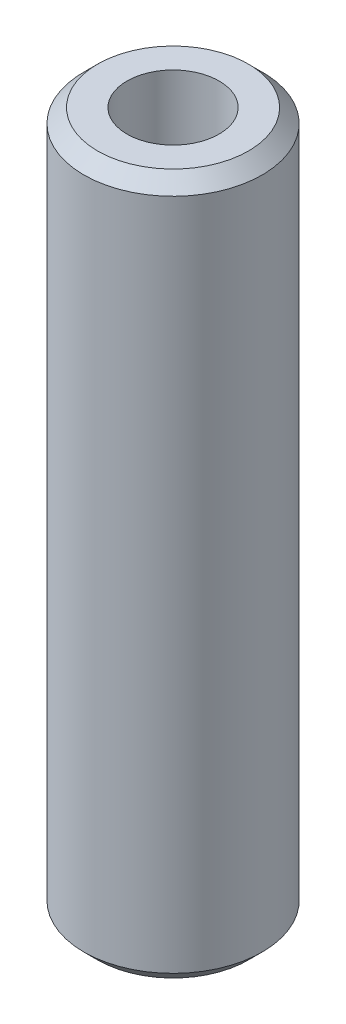
ISO-10303-21;
HEADER;
FILE_DESCRIPTION(('STEP AP214'),'2;1');
FILE_NAME('part.step','',(''),(''),'','','');
FILE_SCHEMA(('AUTOMOTIVE_DESIGN { 1 0 10303 214 1 1 1 1 }'));
ENDSEC;
DATA;
#1=APPLICATION_CONTEXT('core data for automotive mechanical design processes');
#2=APPLICATION_PROTOCOL_DEFINITION('international standard','automotive_design',2000,#1);
#3=PRODUCT_CONTEXT('',#1,'mechanical');
#4=PRODUCT('Part','Part','',(#3));
#5=PRODUCT_RELATED_PRODUCT_CATEGORY('part','',(#4));
#6=PRODUCT_DEFINITION_FORMATION('','',#4);
#7=PRODUCT_DEFINITION_CONTEXT('part definition',#1,'design');
#8=PRODUCT_DEFINITION('design','',#6,#7);
#9=PRODUCT_DEFINITION_SHAPE('','',#8);
#10=(LENGTH_UNIT() NAMED_UNIT(*) SI_UNIT(.MILLI.,.METRE.));
#11=(NAMED_UNIT(*) PLANE_ANGLE_UNIT() SI_UNIT($,.RADIAN.));
#12=(NAMED_UNIT(*) SI_UNIT($,.STERADIAN.) SOLID_ANGLE_UNIT());
#13=UNCERTAINTY_MEASURE_WITH_UNIT(LENGTH_MEASURE(1.E-05),#10,'distance_accuracy_value','');
#14=(GEOMETRIC_REPRESENTATION_CONTEXT(3) GLOBAL_UNCERTAINTY_ASSIGNED_CONTEXT((#13)) GLOBAL_UNIT_ASSIGNED_CONTEXT((#10,
#11,#12)) REPRESENTATION_CONTEXT('',''));
#15=CARTESIAN_POINT('',(0.,0.,0.));
#16=DIRECTION('',(0.,0.,1.));
#17=DIRECTION('',(1.,0.,0.));
#18=AXIS2_PLACEMENT_3D('',#15,#16,#17);
#19=CARTESIAN_POINT('',(0.,98.1937664627016,0.));
#20=DIRECTION('',(0.,-1.,0.));
#21=DIRECTION('',(0.,0.,-1.));
#22=AXIS2_PLACEMENT_3D('',#19,#20,#21);
#23=CYLINDRICAL_SURFACE('',#22,12.5);
#24=CARTESIAN_POINT('',(0.,96.2583801039482,0.));
#25=DIRECTION('',(0.,1.,0.));
#26=DIRECTION('',(0.,0.,1.));
#27=AXIS2_PLACEMENT_3D('',#24,#25,#26);
#28=CIRCLE('',#27,12.5);
#29=CARTESIAN_POINT('',(0.,96.2583801039482,12.5));
#30=VERTEX_POINT('',#29);
#31=EDGE_CURVE('E50',#30,#30,#28,.F.);
#32=ORIENTED_EDGE('',*,*,#31,.T.);
#33=EDGE_LOOP('',(#32));
#34=FACE_BOUND('',#33,.T.);
#35=CARTESIAN_POINT('',(0.,1.9353863587534,0.));
#36=DIRECTION('',(0.,1.,0.));
#37=DIRECTION('',(0.,0.,1.));
#38=AXIS2_PLACEMENT_3D('',#35,#36,#37);
#39=CIRCLE('',#38,12.5);
#40=CARTESIAN_POINT('',(0.,1.9353863587534,12.5));
#41=VERTEX_POINT('',#40);
#42=EDGE_CURVE('E51',#41,#41,#39,.T.);
#43=ORIENTED_EDGE('',*,*,#42,.T.);
#44=EDGE_LOOP('',(#43));
#45=FACE_BOUND('',#44,.T.);
#46=ADVANCED_FACE('F39',(#34,#45),#23,.T.);
#47=CARTESIAN_POINT('',(0.,98.1937664627016,0.));
#48=DIRECTION('',(0.,1.,0.));
#49=DIRECTION('',(0.,0.,1.));
#50=AXIS2_PLACEMENT_3D('',#47,#48,#49);
#51=PLANE('',#50);
#52=CARTESIAN_POINT('',(0.,98.1937664627016,0.));
#53=DIRECTION('',(0.,1.,0.));
#54=DIRECTION('',(0.,0.,1.));
#55=AXIS2_PLACEMENT_3D('',#52,#53,#54);
#56=CIRCLE('',#55,10.5646136412466);
#57=CARTESIAN_POINT('',(0.,98.1937664627016,10.5646136412466));
#58=VERTEX_POINT('',#57);
#59=EDGE_CURVE('E54',#58,#58,#56,.T.);
#60=ORIENTED_EDGE('',*,*,#59,.T.);
#61=EDGE_LOOP('',(#60));
#62=FACE_BOUND('',#61,.T.);
#63=CARTESIAN_POINT('',(0.,98.1937664627016,0.));
#64=DIRECTION('',(0.,1.,0.));
#65=DIRECTION('',(0.,0.,1.));
#66=AXIS2_PLACEMENT_3D('',#63,#64,#65);
#67=CIRCLE('',#66,6.45362802772264);
#68=CARTESIAN_POINT('',(0.,98.1937664627016,6.45362802772264));
#69=VERTEX_POINT('',#68);
#70=EDGE_CURVE('E58',#69,#69,#67,.T.);
#71=ORIENTED_EDGE('',*,*,#70,.F.);
#72=EDGE_LOOP('',(#71));
#73=FACE_BOUND('',#72,.T.);
#74=ADVANCED_FACE('F69',(#62,#73),#51,.T.);
#75=CARTESIAN_POINT('',(0.,0.,0.));
#76=DIRECTION('',(0.,1.,0.));
#77=DIRECTION('',(0.,0.,1.));
#78=AXIS2_PLACEMENT_3D('',#75,#76,#77);
#79=PLANE('',#78);
#80=CARTESIAN_POINT('',(0.,0.,0.));
#81=DIRECTION('',(0.,1.,0.));
#82=DIRECTION('',(0.,0.,1.));
#83=AXIS2_PLACEMENT_3D('',#80,#81,#82);
#84=CIRCLE('',#83,10.5646136412466);
#85=CARTESIAN_POINT('',(0.,0.,10.5646136412466));
#86=VERTEX_POINT('',#85);
#87=EDGE_CURVE('E10',#86,#86,#84,.F.);
#88=ORIENTED_EDGE('',*,*,#87,.T.);
#89=EDGE_LOOP('',(#88));
#90=FACE_BOUND('',#89,.T.);
#91=CARTESIAN_POINT('',(0.,0.,0.));
#92=DIRECTION('',(0.,1.,0.));
#93=DIRECTION('',(0.,0.,1.));
#94=AXIS2_PLACEMENT_3D('',#91,#92,#93);
#95=CIRCLE('',#94,6.45362802772264);
#96=CARTESIAN_POINT('',(0.,0.,6.45362802772264));
#97=VERTEX_POINT('',#96);
#98=EDGE_CURVE('E63',#97,#97,#95,.T.);
#99=ORIENTED_EDGE('',*,*,#98,.T.);
#100=EDGE_LOOP('',(#99));
#101=FACE_BOUND('',#100,.T.);
#102=ADVANCED_FACE('F75',(#90,#101),#79,.F.);
#103=CARTESIAN_POINT('',(0.,98.1937664627016,0.));
#104=DIRECTION('',(0.,-1.,0.));
#105=DIRECTION('',(0.,0.,-1.));
#106=AXIS2_PLACEMENT_3D('',#103,#104,#105);
#107=CYLINDRICAL_SURFACE('',#106,6.45362802772264);
#108=ORIENTED_EDGE('',*,*,#70,.T.);
#109=EDGE_LOOP('',(#108));
#110=FACE_BOUND('',#109,.T.);
#111=ORIENTED_EDGE('',*,*,#98,.F.);
#112=EDGE_LOOP('',(#111));
#113=FACE_BOUND('',#112,.T.);
#114=ADVANCED_FACE('F70',(#110,#113),#107,.F.);
#115=CARTESIAN_POINT('',(0.,98.1937664627016,0.));
#116=DIRECTION('',(0.,-1.,0.));
#117=DIRECTION('',(0.,0.,-1.));
#118=AXIS2_PLACEMENT_3D('',#115,#116,#117);
#119=CONICAL_SURFACE('',#118,10.5646136412466,0.785398163397445);
#120=ORIENTED_EDGE('',*,*,#31,.F.);
#121=EDGE_LOOP('',(#120));
#122=FACE_BOUND('',#121,.T.);
#123=ORIENTED_EDGE('',*,*,#59,.F.);
#124=EDGE_LOOP('',(#123));
#125=FACE_BOUND('',#124,.T.);
#126=ADVANCED_FACE('F81',(#122,#125),#119,.T.);
#127=CARTESIAN_POINT('',(0.,1.9353863587534,0.));
#128=DIRECTION('',(0.,1.,0.));
#129=DIRECTION('',(0.,0.,1.));
#130=AXIS2_PLACEMENT_3D('',#127,#128,#129);
#131=CONICAL_SURFACE('',#130,12.5,0.785398163397449);
#132=ORIENTED_EDGE('',*,*,#87,.F.);
#133=EDGE_LOOP('',(#132));
#134=FACE_BOUND('',#133,.T.);
#135=ORIENTED_EDGE('',*,*,#42,.F.);
#136=EDGE_LOOP('',(#135));
#137=FACE_BOUND('',#136,.T.);
#138=ADVANCED_FACE('F45',(#134,#137),#131,.T.);
#139=CLOSED_SHELL('',(#46,#74,#102,#114,#126,#138));
#140=MANIFOLD_SOLID_BREP('B2',#139);
#141=ADVANCED_BREP_SHAPE_REPRESENTATION('',(#18,#140),#14);
#142=SHAPE_DEFINITION_REPRESENTATION(#9,#141);
ENDSEC;
END-ISO-10303-21;
